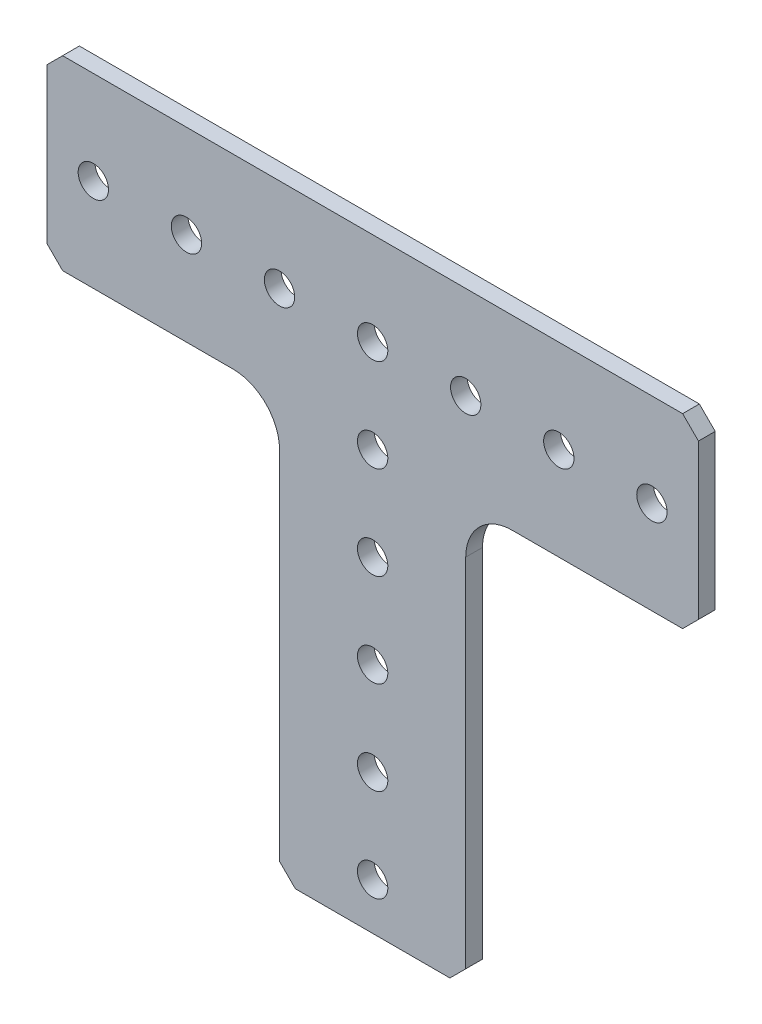
ISO-10303-21;
HEADER;
FILE_DESCRIPTION(('STEP AP214'),'2;1');
FILE_NAME('part.step','',(''),(''),'','','');
FILE_SCHEMA(('AUTOMOTIVE_DESIGN { 1 0 10303 214 1 1 1 1 }'));
ENDSEC;
DATA;
#1=APPLICATION_CONTEXT('core data for automotive mechanical design processes');
#2=APPLICATION_PROTOCOL_DEFINITION('international standard','automotive_design',2000,#1);
#3=PRODUCT_CONTEXT('',#1,'mechanical');
#4=PRODUCT('Part','Part','',(#3));
#5=PRODUCT_RELATED_PRODUCT_CATEGORY('part','',(#4));
#6=PRODUCT_DEFINITION_FORMATION('','',#4);
#7=PRODUCT_DEFINITION_CONTEXT('part definition',#1,'design');
#8=PRODUCT_DEFINITION('design','',#6,#7);
#9=PRODUCT_DEFINITION_SHAPE('','',#8);
#10=(LENGTH_UNIT() NAMED_UNIT(*) SI_UNIT(.MILLI.,.METRE.));
#11=(NAMED_UNIT(*) PLANE_ANGLE_UNIT() SI_UNIT($,.RADIAN.));
#12=(NAMED_UNIT(*) SI_UNIT($,.STERADIAN.) SOLID_ANGLE_UNIT());
#13=UNCERTAINTY_MEASURE_WITH_UNIT(LENGTH_MEASURE(1.E-05),#10,'distance_accuracy_value','');
#14=(GEOMETRIC_REPRESENTATION_CONTEXT(3) GLOBAL_UNCERTAINTY_ASSIGNED_CONTEXT((#13)) GLOBAL_UNIT_ASSIGNED_CONTEXT((#10,
#11,#12)) REPRESENTATION_CONTEXT('',''));
#15=CARTESIAN_POINT('',(0.,0.,0.));
#16=DIRECTION('',(0.,0.,1.));
#17=DIRECTION('',(1.,0.,0.));
#18=AXIS2_PLACEMENT_3D('',#15,#16,#17);
#19=CARTESIAN_POINT('',(10.541,-57.15,0.));
#20=DIRECTION('',(0.707106781186548,-0.707106781186547,0.));
#21=DIRECTION('',(0.707106781186547,0.707106781186548,0.));
#22=AXIS2_PLACEMENT_3D('',#19,#20,#21);
#23=PLANE('',#22);
#24=DIRECTION('',(0.707106781186547,0.707106781186548,0.));
#25=VECTOR('',#24,1.);
#26=CARTESIAN_POINT('',(10.541,-57.15,2.286));
#27=LINE('',#26,#25);
#28=CARTESIAN_POINT('',(10.541,-57.15,2.286));
#29=VERTEX_POINT('',#28);
#30=CARTESIAN_POINT('',(12.7,-54.991,2.286));
#31=VERTEX_POINT('',#30);
#32=EDGE_CURVE('E182',#29,#31,#27,.T.);
#33=ORIENTED_EDGE('',*,*,#32,.F.);
#34=DIRECTION('',(0.,0.,1.));
#35=VECTOR('',#34,1.);
#36=CARTESIAN_POINT('',(10.541,-57.15,0.));
#37=LINE('',#36,#35);
#38=CARTESIAN_POINT('',(10.541,-57.15,0.));
#39=VERTEX_POINT('',#38);
#40=EDGE_CURVE('E11',#39,#29,#37,.T.);
#41=ORIENTED_EDGE('',*,*,#40,.F.);
#42=DIRECTION('',(0.707106781186547,0.707106781186548,0.));
#43=VECTOR('',#42,1.);
#44=CARTESIAN_POINT('',(10.541,-57.15,0.));
#45=LINE('',#44,#43);
#46=CARTESIAN_POINT('',(12.7,-54.991,0.));
#47=VERTEX_POINT('',#46);
#48=EDGE_CURVE('E227',#39,#47,#45,.T.);
#49=ORIENTED_EDGE('',*,*,#48,.T.);
#50=DIRECTION('',(0.,0.,1.));
#51=VECTOR('',#50,1.);
#52=CARTESIAN_POINT('',(12.7,-54.991,0.));
#53=LINE('',#52,#51);
#54=EDGE_CURVE('E40',#47,#31,#53,.T.);
#55=ORIENTED_EDGE('',*,*,#54,.T.);
#56=EDGE_LOOP('',(#33,#41,#49,#55));
#57=FACE_BOUND('',#56,.T.);
#58=ADVANCED_FACE('F37',(#57),#23,.T.);
#59=CARTESIAN_POINT('',(-10.541,-57.15,0.));
#60=DIRECTION('',(0.,-1.,0.));
#61=DIRECTION('',(0.,0.,-1.));
#62=AXIS2_PLACEMENT_3D('',#59,#60,#61);
#63=PLANE('',#62);
#64=DIRECTION('',(1.,0.,0.));
#65=VECTOR('',#64,1.);
#66=CARTESIAN_POINT('',(-10.541,-57.15,2.286));
#67=LINE('',#66,#65);
#68=CARTESIAN_POINT('',(-10.541,-57.15,2.286));
#69=VERTEX_POINT('',#68);
#70=EDGE_CURVE('E225',#69,#29,#67,.T.);
#71=ORIENTED_EDGE('',*,*,#70,.F.);
#72=DIRECTION('',(0.,0.,1.));
#73=VECTOR('',#72,1.);
#74=CARTESIAN_POINT('',(-10.541,-57.15,0.));
#75=LINE('',#74,#73);
#76=CARTESIAN_POINT('',(-10.541,-57.15,0.));
#77=VERTEX_POINT('',#76);
#78=EDGE_CURVE('E46',#77,#69,#75,.T.);
#79=ORIENTED_EDGE('',*,*,#78,.F.);
#80=DIRECTION('',(1.,0.,0.));
#81=VECTOR('',#80,1.);
#82=CARTESIAN_POINT('',(-10.541,-57.15,0.));
#83=LINE('',#82,#81);
#84=EDGE_CURVE('E172',#77,#39,#83,.T.);
#85=ORIENTED_EDGE('',*,*,#84,.T.);
#86=ORIENTED_EDGE('',*,*,#40,.T.);
#87=EDGE_LOOP('',(#71,#79,#85,#86));
#88=FACE_BOUND('',#87,.T.);
#89=ADVANCED_FACE('F255',(#88),#63,.T.);
#90=CARTESIAN_POINT('',(-12.7,-54.991,0.));
#91=DIRECTION('',(-0.707106781186545,-0.70710678118655,0.));
#92=DIRECTION('',(0.70710678118655,-0.707106781186545,0.));
#93=AXIS2_PLACEMENT_3D('',#90,#91,#92);
#94=PLANE('',#93);
#95=DIRECTION('',(0.70710678118655,-0.707106781186545,0.));
#96=VECTOR('',#95,1.);
#97=CARTESIAN_POINT('',(-12.7,-54.991,2.286));
#98=LINE('',#97,#96);
#99=CARTESIAN_POINT('',(-12.7,-54.991,2.286));
#100=VERTEX_POINT('',#99);
#101=EDGE_CURVE('E159',#100,#69,#98,.T.);
#102=ORIENTED_EDGE('',*,*,#101,.F.);
#103=DIRECTION('',(0.,0.,1.));
#104=VECTOR('',#103,1.);
#105=CARTESIAN_POINT('',(-12.7,-54.991,0.));
#106=LINE('',#105,#104);
#107=CARTESIAN_POINT('',(-12.7,-54.991,0.));
#108=VERTEX_POINT('',#107);
#109=EDGE_CURVE('E154',#108,#100,#106,.T.);
#110=ORIENTED_EDGE('',*,*,#109,.F.);
#111=DIRECTION('',(0.70710678118655,-0.707106781186545,0.));
#112=VECTOR('',#111,1.);
#113=CARTESIAN_POINT('',(-12.7,-54.991,0.));
#114=LINE('',#113,#112);
#115=EDGE_CURVE('E157',#108,#77,#114,.T.);
#116=ORIENTED_EDGE('',*,*,#115,.T.);
#117=ORIENTED_EDGE('',*,*,#78,.T.);
#118=EDGE_LOOP('',(#102,#110,#116,#117));
#119=FACE_BOUND('',#118,.T.);
#120=ADVANCED_FACE('F156',(#119),#94,.T.);
#121=CARTESIAN_POINT('',(-12.7,-6.34999999999998,0.));
#122=DIRECTION('',(-1.,0.,0.));
#123=DIRECTION('',(0.,-1.,0.));
#124=AXIS2_PLACEMENT_3D('',#121,#122,#123);
#125=PLANE('',#124);
#126=DIRECTION('',(0.,-1.,0.));
#127=VECTOR('',#126,1.);
#128=CARTESIAN_POINT('',(-12.7,-6.34999999999998,2.286));
#129=LINE('',#128,#127);
#130=CARTESIAN_POINT('',(-12.7,-6.34999999999999,2.286));
#131=VERTEX_POINT('',#130);
#132=EDGE_CURVE('E222',#131,#100,#129,.T.);
#133=ORIENTED_EDGE('',*,*,#132,.F.);
#134=DIRECTION('',(0.,0.,1.));
#135=VECTOR('',#134,1.);
#136=CARTESIAN_POINT('',(-12.7,-6.34999999999999,0.));
#137=LINE('',#136,#135);
#138=CARTESIAN_POINT('',(-12.7,-6.34999999999999,0.));
#139=VERTEX_POINT('',#138);
#140=EDGE_CURVE('E164',#139,#131,#137,.T.);
#141=ORIENTED_EDGE('',*,*,#140,.F.);
#142=DIRECTION('',(0.,-1.,0.));
#143=VECTOR('',#142,1.);
#144=CARTESIAN_POINT('',(-12.7,-6.34999999999998,0.));
#145=LINE('',#144,#143);
#146=EDGE_CURVE('E170',#139,#108,#145,.T.);
#147=ORIENTED_EDGE('',*,*,#146,.T.);
#148=ORIENTED_EDGE('',*,*,#109,.T.);
#149=EDGE_LOOP('',(#133,#141,#147,#148));
#150=FACE_BOUND('',#149,.T.);
#151=ADVANCED_FACE('F174',(#150),#125,.T.);
#152=CARTESIAN_POINT('',(-19.05,-6.34999999999999,0.));
#153=DIRECTION('',(0.,0.,1.));
#154=DIRECTION('',(1.,0.,0.));
#155=AXIS2_PLACEMENT_3D('',#152,#153,#154);
#156=CYLINDRICAL_SURFACE('',#155,6.35);
#157=CARTESIAN_POINT('',(-19.05,-6.34999999999999,2.286));
#158=DIRECTION('',(0.,0.,-1.));
#159=DIRECTION('',(-1.,0.,0.));
#160=AXIS2_PLACEMENT_3D('',#157,#158,#159);
#161=CIRCLE('',#160,6.35);
#162=CARTESIAN_POINT('',(-19.05,0.,2.286));
#163=VERTEX_POINT('',#162);
#164=EDGE_CURVE('E219',#163,#131,#161,.T.);
#165=ORIENTED_EDGE('',*,*,#164,.F.);
#166=DIRECTION('',(0.,0.,1.));
#167=VECTOR('',#166,1.);
#168=CARTESIAN_POINT('',(-19.05,0.,0.));
#169=LINE('',#168,#167);
#170=CARTESIAN_POINT('',(-19.05,0.,0.));
#171=VERTEX_POINT('',#170);
#172=EDGE_CURVE('E231',#171,#163,#169,.T.);
#173=ORIENTED_EDGE('',*,*,#172,.F.);
#174=CARTESIAN_POINT('',(-19.05,-6.34999999999999,0.));
#175=DIRECTION('',(0.,0.,-1.));
#176=DIRECTION('',(-1.,0.,0.));
#177=AXIS2_PLACEMENT_3D('',#174,#175,#176);
#178=CIRCLE('',#177,6.35);
#179=EDGE_CURVE('E175',#171,#139,#178,.T.);
#180=ORIENTED_EDGE('',*,*,#179,.T.);
#181=ORIENTED_EDGE('',*,*,#140,.T.);
#182=EDGE_LOOP('',(#165,#173,#180,#181));
#183=FACE_BOUND('',#182,.T.);
#184=ADVANCED_FACE('F268',(#183),#156,.F.);
#185=CARTESIAN_POINT('',(-42.291,0.,0.));
#186=DIRECTION('',(0.,-1.,0.));
#187=DIRECTION('',(1.,0.,0.));
#188=AXIS2_PLACEMENT_3D('',#185,#186,#187);
#189=PLANE('',#188);
#190=DIRECTION('',(1.,0.,0.));
#191=VECTOR('',#190,1.);
#192=CARTESIAN_POINT('',(-42.291,0.,2.286));
#193=LINE('',#192,#191);
#194=CARTESIAN_POINT('',(-42.291,0.,2.286));
#195=VERTEX_POINT('',#194);
#196=EDGE_CURVE('E216',#195,#163,#193,.T.);
#197=ORIENTED_EDGE('',*,*,#196,.F.);
#198=DIRECTION('',(0.,0.,1.));
#199=VECTOR('',#198,1.);
#200=CARTESIAN_POINT('',(-42.291,0.,0.));
#201=LINE('',#200,#199);
#202=CARTESIAN_POINT('',(-42.291,0.,0.));
#203=VERTEX_POINT('',#202);
#204=EDGE_CURVE('E233',#203,#195,#201,.T.);
#205=ORIENTED_EDGE('',*,*,#204,.F.);
#206=DIRECTION('',(1.,0.,0.));
#207=VECTOR('',#206,1.);
#208=CARTESIAN_POINT('',(-42.291,0.,0.));
#209=LINE('',#208,#207);
#210=EDGE_CURVE('E177',#203,#171,#209,.T.);
#211=ORIENTED_EDGE('',*,*,#210,.T.);
#212=ORIENTED_EDGE('',*,*,#172,.T.);
#213=EDGE_LOOP('',(#197,#205,#211,#212));
#214=FACE_BOUND('',#213,.T.);
#215=ADVANCED_FACE('F271',(#214),#189,.T.);
#216=CARTESIAN_POINT('',(-44.45,2.15899999999999,0.));
#217=DIRECTION('',(-0.707106781186545,-0.70710678118655,0.));
#218=DIRECTION('',(0.70710678118655,-0.707106781186545,0.));
#219=AXIS2_PLACEMENT_3D('',#216,#217,#218);
#220=PLANE('',#219);
#221=DIRECTION('',(0.70710678118655,-0.707106781186545,0.));
#222=VECTOR('',#221,1.);
#223=CARTESIAN_POINT('',(-44.45,2.15899999999999,2.286));
#224=LINE('',#223,#222);
#225=CARTESIAN_POINT('',(-44.45,2.15899999999999,2.286));
#226=VERTEX_POINT('',#225);
#227=EDGE_CURVE('E213',#226,#195,#224,.T.);
#228=ORIENTED_EDGE('',*,*,#227,.F.);
#229=DIRECTION('',(0.,0.,1.));
#230=VECTOR('',#229,1.);
#231=CARTESIAN_POINT('',(-44.45,2.15899999999999,0.));
#232=LINE('',#231,#230);
#233=CARTESIAN_POINT('',(-44.45,2.15899999999999,0.));
#234=VERTEX_POINT('',#233);
#235=EDGE_CURVE('E235',#234,#226,#232,.T.);
#236=ORIENTED_EDGE('',*,*,#235,.F.);
#237=DIRECTION('',(0.70710678118655,-0.707106781186545,0.));
#238=VECTOR('',#237,1.);
#239=CARTESIAN_POINT('',(-44.45,2.15899999999999,0.));
#240=LINE('',#239,#238);
#241=EDGE_CURVE('E473',#234,#203,#240,.T.);
#242=ORIENTED_EDGE('',*,*,#241,.T.);
#243=ORIENTED_EDGE('',*,*,#204,.T.);
#244=EDGE_LOOP('',(#228,#236,#242,#243));
#245=FACE_BOUND('',#244,.T.);
#246=ADVANCED_FACE('F275',(#245),#220,.T.);
#247=CARTESIAN_POINT('',(-44.45,23.241,0.));
#248=DIRECTION('',(-1.,0.,0.));
#249=DIRECTION('',(0.,-1.,0.));
#250=AXIS2_PLACEMENT_3D('',#247,#248,#249);
#251=PLANE('',#250);
#252=DIRECTION('',(0.,-1.,0.));
#253=VECTOR('',#252,1.);
#254=CARTESIAN_POINT('',(-44.45,23.241,2.286));
#255=LINE('',#254,#253);
#256=CARTESIAN_POINT('',(-44.45,23.241,2.286));
#257=VERTEX_POINT('',#256);
#258=EDGE_CURVE('E210',#257,#226,#255,.T.);
#259=ORIENTED_EDGE('',*,*,#258,.F.);
#260=DIRECTION('',(0.,0.,1.));
#261=VECTOR('',#260,1.);
#262=CARTESIAN_POINT('',(-44.45,23.241,0.));
#263=LINE('',#262,#261);
#264=CARTESIAN_POINT('',(-44.45,23.241,0.));
#265=VERTEX_POINT('',#264);
#266=EDGE_CURVE('E237',#265,#257,#263,.T.);
#267=ORIENTED_EDGE('',*,*,#266,.F.);
#268=DIRECTION('',(0.,-1.,0.));
#269=VECTOR('',#268,1.);
#270=CARTESIAN_POINT('',(-44.45,23.241,0.));
#271=LINE('',#270,#269);
#272=EDGE_CURVE('E470',#265,#234,#271,.T.);
#273=ORIENTED_EDGE('',*,*,#272,.T.);
#274=ORIENTED_EDGE('',*,*,#235,.T.);
#275=EDGE_LOOP('',(#259,#267,#273,#274));
#276=FACE_BOUND('',#275,.T.);
#277=ADVANCED_FACE('F279',(#276),#251,.T.);
#278=CARTESIAN_POINT('',(-42.291,25.4,0.));
#279=DIRECTION('',(-0.707106781186543,0.707106781186552,0.));
#280=DIRECTION('',(-0.707106781186552,-0.707106781186543,0.));
#281=AXIS2_PLACEMENT_3D('',#278,#279,#280);
#282=PLANE('',#281);
#283=DIRECTION('',(-0.707106781186552,-0.707106781186543,0.));
#284=VECTOR('',#283,1.);
#285=CARTESIAN_POINT('',(-42.291,25.4,2.286));
#286=LINE('',#285,#284);
#287=CARTESIAN_POINT('',(-42.291,25.4,2.286));
#288=VERTEX_POINT('',#287);
#289=EDGE_CURVE('E207',#288,#257,#286,.T.);
#290=ORIENTED_EDGE('',*,*,#289,.F.);
#291=DIRECTION('',(0.,0.,1.));
#292=VECTOR('',#291,1.);
#293=CARTESIAN_POINT('',(-42.291,25.4,0.));
#294=LINE('',#293,#292);
#295=CARTESIAN_POINT('',(-42.291,25.4,0.));
#296=VERTEX_POINT('',#295);
#297=EDGE_CURVE('E239',#296,#288,#294,.T.);
#298=ORIENTED_EDGE('',*,*,#297,.F.);
#299=DIRECTION('',(-0.707106781186552,-0.707106781186543,0.));
#300=VECTOR('',#299,1.);
#301=CARTESIAN_POINT('',(-42.291,25.4,0.));
#302=LINE('',#301,#300);
#303=EDGE_CURVE('E467',#296,#265,#302,.T.);
#304=ORIENTED_EDGE('',*,*,#303,.T.);
#305=ORIENTED_EDGE('',*,*,#266,.T.);
#306=EDGE_LOOP('',(#290,#298,#304,#305));
#307=FACE_BOUND('',#306,.T.);
#308=ADVANCED_FACE('F283',(#307),#282,.T.);
#309=CARTESIAN_POINT('',(42.291,25.4,0.));
#310=DIRECTION('',(0.,1.,0.));
#311=DIRECTION('',(-1.,0.,0.));
#312=AXIS2_PLACEMENT_3D('',#309,#310,#311);
#313=PLANE('',#312);
#314=DIRECTION('',(-1.,0.,0.));
#315=VECTOR('',#314,1.);
#316=CARTESIAN_POINT('',(42.291,25.4,2.286));
#317=LINE('',#316,#315);
#318=CARTESIAN_POINT('',(42.291,25.4,2.286));
#319=VERTEX_POINT('',#318);
#320=EDGE_CURVE('E204',#319,#288,#317,.T.);
#321=ORIENTED_EDGE('',*,*,#320,.F.);
#322=DIRECTION('',(0.,0.,1.));
#323=VECTOR('',#322,1.);
#324=CARTESIAN_POINT('',(42.291,25.4,0.));
#325=LINE('',#324,#323);
#326=CARTESIAN_POINT('',(42.291,25.4,0.));
#327=VERTEX_POINT('',#326);
#328=EDGE_CURVE('E241',#327,#319,#325,.T.);
#329=ORIENTED_EDGE('',*,*,#328,.F.);
#330=DIRECTION('',(-1.,0.,0.));
#331=VECTOR('',#330,1.);
#332=CARTESIAN_POINT('',(42.291,25.4,0.));
#333=LINE('',#332,#331);
#334=EDGE_CURVE('E464',#327,#296,#333,.T.);
#335=ORIENTED_EDGE('',*,*,#334,.T.);
#336=ORIENTED_EDGE('',*,*,#297,.T.);
#337=EDGE_LOOP('',(#321,#329,#335,#336));
#338=FACE_BOUND('',#337,.T.);
#339=ADVANCED_FACE('F287',(#338),#313,.T.);
#340=CARTESIAN_POINT('',(44.45,23.241,0.));
#341=DIRECTION('',(0.707106781186546,0.707106781186549,0.));
#342=DIRECTION('',(-0.707106781186549,0.707106781186546,0.));
#343=AXIS2_PLACEMENT_3D('',#340,#341,#342);
#344=PLANE('',#343);
#345=DIRECTION('',(-0.707106781186549,0.707106781186546,0.));
#346=VECTOR('',#345,1.);
#347=CARTESIAN_POINT('',(44.45,23.241,2.286));
#348=LINE('',#347,#346);
#349=CARTESIAN_POINT('',(44.45,23.241,2.286));
#350=VERTEX_POINT('',#349);
#351=EDGE_CURVE('E201',#350,#319,#348,.T.);
#352=ORIENTED_EDGE('',*,*,#351,.F.);
#353=DIRECTION('',(0.,0.,1.));
#354=VECTOR('',#353,1.);
#355=CARTESIAN_POINT('',(44.45,23.241,0.));
#356=LINE('',#355,#354);
#357=CARTESIAN_POINT('',(44.45,23.241,0.));
#358=VERTEX_POINT('',#357);
#359=EDGE_CURVE('E243',#358,#350,#356,.T.);
#360=ORIENTED_EDGE('',*,*,#359,.F.);
#361=DIRECTION('',(-0.707106781186549,0.707106781186546,0.));
#362=VECTOR('',#361,1.);
#363=CARTESIAN_POINT('',(44.45,23.241,0.));
#364=LINE('',#363,#362);
#365=EDGE_CURVE('E461',#358,#327,#364,.T.);
#366=ORIENTED_EDGE('',*,*,#365,.T.);
#367=ORIENTED_EDGE('',*,*,#328,.T.);
#368=EDGE_LOOP('',(#352,#360,#366,#367));
#369=FACE_BOUND('',#368,.T.);
#370=ADVANCED_FACE('F291',(#369),#344,.T.);
#371=CARTESIAN_POINT('',(44.45,2.15900000000002,0.));
#372=DIRECTION('',(1.,0.,0.));
#373=DIRECTION('',(0.,1.,0.));
#374=AXIS2_PLACEMENT_3D('',#371,#372,#373);
#375=PLANE('',#374);
#376=DIRECTION('',(0.,1.,0.));
#377=VECTOR('',#376,1.);
#378=CARTESIAN_POINT('',(44.45,2.15900000000002,2.286));
#379=LINE('',#378,#377);
#380=CARTESIAN_POINT('',(44.45,2.15900000000002,2.286));
#381=VERTEX_POINT('',#380);
#382=EDGE_CURVE('E198',#381,#350,#379,.T.);
#383=ORIENTED_EDGE('',*,*,#382,.F.);
#384=DIRECTION('',(0.,0.,1.));
#385=VECTOR('',#384,1.);
#386=CARTESIAN_POINT('',(44.45,2.15900000000002,0.));
#387=LINE('',#386,#385);
#388=CARTESIAN_POINT('',(44.45,2.15900000000002,0.));
#389=VERTEX_POINT('',#388);
#390=EDGE_CURVE('E245',#389,#381,#387,.T.);
#391=ORIENTED_EDGE('',*,*,#390,.F.);
#392=DIRECTION('',(0.,1.,0.));
#393=VECTOR('',#392,1.);
#394=CARTESIAN_POINT('',(44.45,2.15900000000002,0.));
#395=LINE('',#394,#393);
#396=EDGE_CURVE('E458',#389,#358,#395,.T.);
#397=ORIENTED_EDGE('',*,*,#396,.T.);
#398=ORIENTED_EDGE('',*,*,#359,.T.);
#399=EDGE_LOOP('',(#383,#391,#397,#398));
#400=FACE_BOUND('',#399,.T.);
#401=ADVANCED_FACE('F295',(#400),#375,.T.);
#402=CARTESIAN_POINT('',(42.291,0.,0.));
#403=DIRECTION('',(0.707106781186549,-0.707106781186547,0.));
#404=DIRECTION('',(0.707106781186547,0.707106781186549,0.));
#405=AXIS2_PLACEMENT_3D('',#402,#403,#404);
#406=PLANE('',#405);
#407=DIRECTION('',(0.707106781186546,0.707106781186548,0.));
#408=VECTOR('',#407,1.);
#409=CARTESIAN_POINT('',(42.291,0.,2.286));
#410=LINE('',#409,#408);
#411=CARTESIAN_POINT('',(42.291,0.,2.286));
#412=VERTEX_POINT('',#411);
#413=EDGE_CURVE('E195',#412,#381,#410,.T.);
#414=ORIENTED_EDGE('',*,*,#413,.F.);
#415=DIRECTION('',(0.,0.,1.));
#416=VECTOR('',#415,1.);
#417=CARTESIAN_POINT('',(42.291,0.,0.));
#418=LINE('',#417,#416);
#419=CARTESIAN_POINT('',(42.291,0.,0.));
#420=VERTEX_POINT('',#419);
#421=EDGE_CURVE('E247',#420,#412,#418,.T.);
#422=ORIENTED_EDGE('',*,*,#421,.F.);
#423=DIRECTION('',(0.707106781186546,0.707106781186548,0.));
#424=VECTOR('',#423,1.);
#425=CARTESIAN_POINT('',(42.291,0.,0.));
#426=LINE('',#425,#424);
#427=EDGE_CURVE('E455',#420,#389,#426,.T.);
#428=ORIENTED_EDGE('',*,*,#427,.T.);
#429=ORIENTED_EDGE('',*,*,#390,.T.);
#430=EDGE_LOOP('',(#414,#422,#428,#429));
#431=FACE_BOUND('',#430,.T.);
#432=ADVANCED_FACE('F299',(#431),#406,.T.);
#433=CARTESIAN_POINT('',(19.05,0.,0.));
#434=DIRECTION('',(0.,-1.,0.));
#435=DIRECTION('',(1.,0.,0.));
#436=AXIS2_PLACEMENT_3D('',#433,#434,#435);
#437=PLANE('',#436);
#438=DIRECTION('',(1.,0.,0.));
#439=VECTOR('',#438,1.);
#440=CARTESIAN_POINT('',(19.05,0.,2.286));
#441=LINE('',#440,#439);
#442=CARTESIAN_POINT('',(19.05,0.,2.286));
#443=VERTEX_POINT('',#442);
#444=EDGE_CURVE('E192',#443,#412,#441,.T.);
#445=ORIENTED_EDGE('',*,*,#444,.F.);
#446=DIRECTION('',(0.,0.,1.));
#447=VECTOR('',#446,1.);
#448=CARTESIAN_POINT('',(19.05,0.,0.));
#449=LINE('',#448,#447);
#450=CARTESIAN_POINT('',(19.05,0.,0.));
#451=VERTEX_POINT('',#450);
#452=EDGE_CURVE('E249',#451,#443,#449,.T.);
#453=ORIENTED_EDGE('',*,*,#452,.F.);
#454=DIRECTION('',(1.,0.,0.));
#455=VECTOR('',#454,1.);
#456=CARTESIAN_POINT('',(19.05,0.,0.));
#457=LINE('',#456,#455);
#458=EDGE_CURVE('E452',#451,#420,#457,.T.);
#459=ORIENTED_EDGE('',*,*,#458,.T.);
#460=ORIENTED_EDGE('',*,*,#421,.T.);
#461=EDGE_LOOP('',(#445,#453,#459,#460));
#462=FACE_BOUND('',#461,.T.);
#463=ADVANCED_FACE('F303',(#462),#437,.T.);
#464=CARTESIAN_POINT('',(19.05,-6.34999999999998,0.));
#465=DIRECTION('',(0.,0.,1.));
#466=DIRECTION('',(1.,0.,0.));
#467=AXIS2_PLACEMENT_3D('',#464,#465,#466);
#468=CYLINDRICAL_SURFACE('',#467,6.35);
#469=CARTESIAN_POINT('',(19.05,-6.34999999999998,2.286));
#470=DIRECTION('',(0.,0.,-1.));
#471=DIRECTION('',(-1.,0.,0.));
#472=AXIS2_PLACEMENT_3D('',#469,#470,#471);
#473=CIRCLE('',#472,6.35);
#474=CARTESIAN_POINT('',(12.7,-6.34999999999998,2.286));
#475=VERTEX_POINT('',#474);
#476=EDGE_CURVE('E189',#475,#443,#473,.T.);
#477=ORIENTED_EDGE('',*,*,#476,.F.);
#478=DIRECTION('',(0.,0.,1.));
#479=VECTOR('',#478,1.);
#480=CARTESIAN_POINT('',(12.7,-6.34999999999998,0.));
#481=LINE('',#480,#479);
#482=CARTESIAN_POINT('',(12.7,-6.34999999999998,0.));
#483=VERTEX_POINT('',#482);
#484=EDGE_CURVE('E250',#483,#475,#481,.T.);
#485=ORIENTED_EDGE('',*,*,#484,.F.);
#486=CARTESIAN_POINT('',(19.05,-6.34999999999998,0.));
#487=DIRECTION('',(0.,0.,-1.));
#488=DIRECTION('',(-1.,0.,0.));
#489=AXIS2_PLACEMENT_3D('',#486,#487,#488);
#490=CIRCLE('',#489,6.35);
#491=EDGE_CURVE('E449',#483,#451,#490,.T.);
#492=ORIENTED_EDGE('',*,*,#491,.T.);
#493=ORIENTED_EDGE('',*,*,#452,.T.);
#494=EDGE_LOOP('',(#477,#485,#492,#493));
#495=FACE_BOUND('',#494,.T.);
#496=ADVANCED_FACE('F307',(#495),#468,.F.);
#497=CARTESIAN_POINT('',(12.7,-54.991,0.));
#498=DIRECTION('',(1.,0.,0.));
#499=DIRECTION('',(0.,1.,0.));
#500=AXIS2_PLACEMENT_3D('',#497,#498,#499);
#501=PLANE('',#500);
#502=DIRECTION('',(0.,1.,0.));
#503=VECTOR('',#502,1.);
#504=CARTESIAN_POINT('',(12.7,-54.991,2.286));
#505=LINE('',#504,#503);
#506=EDGE_CURVE('E185',#31,#475,#505,.T.);
#507=ORIENTED_EDGE('',*,*,#506,.F.);
#508=ORIENTED_EDGE('',*,*,#54,.F.);
#509=DIRECTION('',(0.,1.,0.));
#510=VECTOR('',#509,1.);
#511=CARTESIAN_POINT('',(12.7,-54.991,0.));
#512=LINE('',#511,#510);
#513=EDGE_CURVE('E447',#47,#483,#512,.T.);
#514=ORIENTED_EDGE('',*,*,#513,.T.);
#515=ORIENTED_EDGE('',*,*,#484,.T.);
#516=EDGE_LOOP('',(#507,#508,#514,#515));
#517=FACE_BOUND('',#516,.T.);
#518=ADVANCED_FACE('F252',(#517),#501,.T.);
#519=CARTESIAN_POINT('',(19.05,-6.34999999999998,0.));
#520=DIRECTION('',(0.,0.,-1.));
#521=DIRECTION('',(-1.,0.,0.));
#522=AXIS2_PLACEMENT_3D('',#519,#520,#521);
#523=PLANE('',#522);
#524=CARTESIAN_POINT('',(0.,-50.8,0.));
#525=DIRECTION('',(0.,0.,1.));
#526=DIRECTION('',(-1.,0.,0.));
#527=AXIS2_PLACEMENT_3D('',#524,#525,#526);
#528=CIRCLE('',#527,2.0701);
#529=CARTESIAN_POINT('',(-2.07009999999999,-50.8,0.));
#530=VERTEX_POINT('',#529);
#531=EDGE_CURVE('E374',#530,#530,#528,.T.);
#532=ORIENTED_EDGE('',*,*,#531,.T.);
#533=EDGE_LOOP('',(#532));
#534=FACE_BOUND('',#533,.T.);
#535=CARTESIAN_POINT('',(0.,-25.4,0.));
#536=DIRECTION('',(0.,0.,1.));
#537=DIRECTION('',(-1.,0.,0.));
#538=AXIS2_PLACEMENT_3D('',#535,#536,#537);
#539=CIRCLE('',#538,2.0701);
#540=CARTESIAN_POINT('',(-2.0701,-25.4,0.));
#541=VERTEX_POINT('',#540);
#542=EDGE_CURVE('E382',#541,#541,#539,.T.);
#543=ORIENTED_EDGE('',*,*,#542,.T.);
#544=EDGE_LOOP('',(#543));
#545=FACE_BOUND('',#544,.T.);
#546=CARTESIAN_POINT('',(0.,0.,0.));
#547=DIRECTION('',(0.,0.,1.));
#548=DIRECTION('',(-1.,0.,0.));
#549=AXIS2_PLACEMENT_3D('',#546,#547,#548);
#550=CIRCLE('',#549,2.0701);
#551=CARTESIAN_POINT('',(-2.0701,0.,0.));
#552=VERTEX_POINT('',#551);
#553=EDGE_CURVE('E388',#552,#552,#550,.T.);
#554=ORIENTED_EDGE('',*,*,#553,.T.);
#555=EDGE_LOOP('',(#554));
#556=FACE_BOUND('',#555,.T.);
#557=CARTESIAN_POINT('',(25.4,12.7,0.));
#558=DIRECTION('',(0.,0.,1.));
#559=DIRECTION('',(-1.,0.,0.));
#560=AXIS2_PLACEMENT_3D('',#557,#558,#559);
#561=CIRCLE('',#560,2.0701);
#562=CARTESIAN_POINT('',(23.3299,12.7,0.));
#563=VERTEX_POINT('',#562);
#564=EDGE_CURVE('E394',#563,#563,#561,.T.);
#565=ORIENTED_EDGE('',*,*,#564,.T.);
#566=EDGE_LOOP('',(#565));
#567=FACE_BOUND('',#566,.T.);
#568=CARTESIAN_POINT('',(0.,12.7,0.));
#569=DIRECTION('',(0.,0.,1.));
#570=DIRECTION('',(-1.,0.,0.));
#571=AXIS2_PLACEMENT_3D('',#568,#569,#570);
#572=CIRCLE('',#571,2.0701);
#573=CARTESIAN_POINT('',(-2.0701,12.7,0.));
#574=VERTEX_POINT('',#573);
#575=EDGE_CURVE('E400',#574,#574,#572,.T.);
#576=ORIENTED_EDGE('',*,*,#575,.T.);
#577=EDGE_LOOP('',(#576));
#578=FACE_BOUND('',#577,.T.);
#579=CARTESIAN_POINT('',(-25.4,12.7,0.));
#580=DIRECTION('',(0.,0.,1.));
#581=DIRECTION('',(-1.,0.,0.));
#582=AXIS2_PLACEMENT_3D('',#579,#580,#581);
#583=CIRCLE('',#582,2.0701);
#584=CARTESIAN_POINT('',(-27.4701,12.7,0.));
#585=VERTEX_POINT('',#584);
#586=EDGE_CURVE('E406',#585,#585,#583,.T.);
#587=ORIENTED_EDGE('',*,*,#586,.T.);
#588=EDGE_LOOP('',(#587));
#589=FACE_BOUND('',#588,.T.);
#590=CARTESIAN_POINT('',(-38.1,12.7,0.));
#591=DIRECTION('',(0.,0.,1.));
#592=DIRECTION('',(-1.,0.,0.));
#593=AXIS2_PLACEMENT_3D('',#590,#591,#592);
#594=CIRCLE('',#593,2.0701);
#595=CARTESIAN_POINT('',(-40.1701,12.7,0.));
#596=VERTEX_POINT('',#595);
#597=EDGE_CURVE('E412',#596,#596,#594,.T.);
#598=ORIENTED_EDGE('',*,*,#597,.T.);
#599=EDGE_LOOP('',(#598));
#600=FACE_BOUND('',#599,.T.);
#601=CARTESIAN_POINT('',(-12.7,12.7,0.));
#602=DIRECTION('',(0.,0.,1.));
#603=DIRECTION('',(-1.,0.,0.));
#604=AXIS2_PLACEMENT_3D('',#601,#602,#603);
#605=CIRCLE('',#604,2.0701);
#606=CARTESIAN_POINT('',(-14.7701,12.7,0.));
#607=VERTEX_POINT('',#606);
#608=EDGE_CURVE('E418',#607,#607,#605,.T.);
#609=ORIENTED_EDGE('',*,*,#608,.T.);
#610=EDGE_LOOP('',(#609));
#611=FACE_BOUND('',#610,.T.);
#612=CARTESIAN_POINT('',(12.7,12.7,0.));
#613=DIRECTION('',(0.,0.,1.));
#614=DIRECTION('',(-1.,0.,0.));
#615=AXIS2_PLACEMENT_3D('',#612,#613,#614);
#616=CIRCLE('',#615,2.0701);
#617=CARTESIAN_POINT('',(10.6299,12.7,0.));
#618=VERTEX_POINT('',#617);
#619=EDGE_CURVE('E424',#618,#618,#616,.T.);
#620=ORIENTED_EDGE('',*,*,#619,.T.);
#621=EDGE_LOOP('',(#620));
#622=FACE_BOUND('',#621,.T.);
#623=CARTESIAN_POINT('',(38.1,12.7,0.));
#624=DIRECTION('',(0.,0.,1.));
#625=DIRECTION('',(-1.,0.,0.));
#626=AXIS2_PLACEMENT_3D('',#623,#624,#625);
#627=CIRCLE('',#626,2.0701);
#628=CARTESIAN_POINT('',(36.0299,12.7,0.));
#629=VERTEX_POINT('',#628);
#630=EDGE_CURVE('E430',#629,#629,#627,.T.);
#631=ORIENTED_EDGE('',*,*,#630,.T.);
#632=EDGE_LOOP('',(#631));
#633=FACE_BOUND('',#632,.T.);
#634=CARTESIAN_POINT('',(0.,-12.7,0.));
#635=DIRECTION('',(0.,0.,1.));
#636=DIRECTION('',(-1.,0.,0.));
#637=AXIS2_PLACEMENT_3D('',#634,#635,#636);
#638=CIRCLE('',#637,2.0701);
#639=CARTESIAN_POINT('',(-2.0701,-12.7,0.));
#640=VERTEX_POINT('',#639);
#641=EDGE_CURVE('E436',#640,#640,#638,.T.);
#642=ORIENTED_EDGE('',*,*,#641,.T.);
#643=EDGE_LOOP('',(#642));
#644=FACE_BOUND('',#643,.T.);
#645=CARTESIAN_POINT('',(0.,-38.1,0.));
#646=DIRECTION('',(0.,0.,1.));
#647=DIRECTION('',(-1.,0.,0.));
#648=AXIS2_PLACEMENT_3D('',#645,#646,#647);
#649=CIRCLE('',#648,2.0701);
#650=CARTESIAN_POINT('',(-2.0701,-38.1,0.));
#651=VERTEX_POINT('',#650);
#652=EDGE_CURVE('E186',#651,#651,#649,.T.);
#653=ORIENTED_EDGE('',*,*,#652,.T.);
#654=EDGE_LOOP('',(#653));
#655=FACE_BOUND('',#654,.T.);
#656=ORIENTED_EDGE('',*,*,#48,.F.);
#657=ORIENTED_EDGE('',*,*,#84,.F.);
#658=ORIENTED_EDGE('',*,*,#115,.F.);
#659=ORIENTED_EDGE('',*,*,#146,.F.);
#660=ORIENTED_EDGE('',*,*,#179,.F.);
#661=ORIENTED_EDGE('',*,*,#210,.F.);
#662=ORIENTED_EDGE('',*,*,#241,.F.);
#663=ORIENTED_EDGE('',*,*,#272,.F.);
#664=ORIENTED_EDGE('',*,*,#303,.F.);
#665=ORIENTED_EDGE('',*,*,#334,.F.);
#666=ORIENTED_EDGE('',*,*,#365,.F.);
#667=ORIENTED_EDGE('',*,*,#396,.F.);
#668=ORIENTED_EDGE('',*,*,#427,.F.);
#669=ORIENTED_EDGE('',*,*,#458,.F.);
#670=ORIENTED_EDGE('',*,*,#491,.F.);
#671=ORIENTED_EDGE('',*,*,#513,.F.);
#672=EDGE_LOOP('',(#656,#657,#658,#659,#660,#661,#662,#663,#664,#665,#666,#667,#668,#669,#670,#671));
#673=FACE_BOUND('',#672,.T.);
#674=ADVANCED_FACE('F168',(#534,#545,#556,#567,#578,#589,#600,#611,#622,#633,#644,#655,#673),
#523,.T.);
#675=CARTESIAN_POINT('',(19.05,-6.34999999999998,2.286));
#676=DIRECTION('',(0.,0.,-1.));
#677=DIRECTION('',(-1.,0.,0.));
#678=AXIS2_PLACEMENT_3D('',#675,#676,#677);
#679=PLANE('',#678);
#680=CARTESIAN_POINT('',(0.,-50.8,2.286));
#681=DIRECTION('',(0.,0.,1.));
#682=DIRECTION('',(-1.,0.,0.));
#683=AXIS2_PLACEMENT_3D('',#680,#681,#682);
#684=CIRCLE('',#683,2.0701);
#685=CARTESIAN_POINT('',(-2.07009999999999,-50.8,2.286));
#686=VERTEX_POINT('',#685);
#687=EDGE_CURVE('E377',#686,#686,#684,.T.);
#688=ORIENTED_EDGE('',*,*,#687,.F.);
#689=EDGE_LOOP('',(#688));
#690=FACE_BOUND('',#689,.T.);
#691=CARTESIAN_POINT('',(0.,-25.4,2.286));
#692=DIRECTION('',(0.,0.,1.));
#693=DIRECTION('',(-1.,0.,0.));
#694=AXIS2_PLACEMENT_3D('',#691,#692,#693);
#695=CIRCLE('',#694,2.0701);
#696=CARTESIAN_POINT('',(-2.0701,-25.4,2.286));
#697=VERTEX_POINT('',#696);
#698=EDGE_CURVE('E379',#697,#697,#695,.T.);
#699=ORIENTED_EDGE('',*,*,#698,.F.);
#700=EDGE_LOOP('',(#699));
#701=FACE_BOUND('',#700,.T.);
#702=CARTESIAN_POINT('',(0.,0.,2.286));
#703=DIRECTION('',(0.,0.,1.));
#704=DIRECTION('',(-1.,0.,0.));
#705=AXIS2_PLACEMENT_3D('',#702,#703,#704);
#706=CIRCLE('',#705,2.0701);
#707=CARTESIAN_POINT('',(-2.0701,0.,2.286));
#708=VERTEX_POINT('',#707);
#709=EDGE_CURVE('E385',#708,#708,#706,.T.);
#710=ORIENTED_EDGE('',*,*,#709,.F.);
#711=EDGE_LOOP('',(#710));
#712=FACE_BOUND('',#711,.T.);
#713=CARTESIAN_POINT('',(25.4,12.7,2.286));
#714=DIRECTION('',(0.,0.,1.));
#715=DIRECTION('',(-1.,0.,0.));
#716=AXIS2_PLACEMENT_3D('',#713,#714,#715);
#717=CIRCLE('',#716,2.0701);
#718=CARTESIAN_POINT('',(23.3299,12.7,2.286));
#719=VERTEX_POINT('',#718);
#720=EDGE_CURVE('E391',#719,#719,#717,.T.);
#721=ORIENTED_EDGE('',*,*,#720,.F.);
#722=EDGE_LOOP('',(#721));
#723=FACE_BOUND('',#722,.T.);
#724=CARTESIAN_POINT('',(0.,12.7,2.286));
#725=DIRECTION('',(0.,0.,1.));
#726=DIRECTION('',(-1.,0.,0.));
#727=AXIS2_PLACEMENT_3D('',#724,#725,#726);
#728=CIRCLE('',#727,2.0701);
#729=CARTESIAN_POINT('',(-2.0701,12.7,2.286));
#730=VERTEX_POINT('',#729);
#731=EDGE_CURVE('E397',#730,#730,#728,.T.);
#732=ORIENTED_EDGE('',*,*,#731,.F.);
#733=EDGE_LOOP('',(#732));
#734=FACE_BOUND('',#733,.T.);
#735=CARTESIAN_POINT('',(-25.4,12.7,2.286));
#736=DIRECTION('',(0.,0.,1.));
#737=DIRECTION('',(-1.,0.,0.));
#738=AXIS2_PLACEMENT_3D('',#735,#736,#737);
#739=CIRCLE('',#738,2.0701);
#740=CARTESIAN_POINT('',(-27.4701,12.7,2.286));
#741=VERTEX_POINT('',#740);
#742=EDGE_CURVE('E403',#741,#741,#739,.T.);
#743=ORIENTED_EDGE('',*,*,#742,.F.);
#744=EDGE_LOOP('',(#743));
#745=FACE_BOUND('',#744,.T.);
#746=CARTESIAN_POINT('',(-38.1,12.7,2.286));
#747=DIRECTION('',(0.,0.,1.));
#748=DIRECTION('',(-1.,0.,0.));
#749=AXIS2_PLACEMENT_3D('',#746,#747,#748);
#750=CIRCLE('',#749,2.0701);
#751=CARTESIAN_POINT('',(-40.1701,12.7,2.286));
#752=VERTEX_POINT('',#751);
#753=EDGE_CURVE('E409',#752,#752,#750,.T.);
#754=ORIENTED_EDGE('',*,*,#753,.F.);
#755=EDGE_LOOP('',(#754));
#756=FACE_BOUND('',#755,.T.);
#757=CARTESIAN_POINT('',(-12.7,12.7,2.286));
#758=DIRECTION('',(0.,0.,1.));
#759=DIRECTION('',(-1.,0.,0.));
#760=AXIS2_PLACEMENT_3D('',#757,#758,#759);
#761=CIRCLE('',#760,2.0701);
#762=CARTESIAN_POINT('',(-14.7701,12.7,2.286));
#763=VERTEX_POINT('',#762);
#764=EDGE_CURVE('E415',#763,#763,#761,.T.);
#765=ORIENTED_EDGE('',*,*,#764,.F.);
#766=EDGE_LOOP('',(#765));
#767=FACE_BOUND('',#766,.T.);
#768=CARTESIAN_POINT('',(12.7,12.7,2.286));
#769=DIRECTION('',(0.,0.,1.));
#770=DIRECTION('',(-1.,0.,0.));
#771=AXIS2_PLACEMENT_3D('',#768,#769,#770);
#772=CIRCLE('',#771,2.0701);
#773=CARTESIAN_POINT('',(10.6299,12.7,2.286));
#774=VERTEX_POINT('',#773);
#775=EDGE_CURVE('E421',#774,#774,#772,.T.);
#776=ORIENTED_EDGE('',*,*,#775,.F.);
#777=EDGE_LOOP('',(#776));
#778=FACE_BOUND('',#777,.T.);
#779=CARTESIAN_POINT('',(38.1,12.7,2.286));
#780=DIRECTION('',(0.,0.,1.));
#781=DIRECTION('',(-1.,0.,0.));
#782=AXIS2_PLACEMENT_3D('',#779,#780,#781);
#783=CIRCLE('',#782,2.0701);
#784=CARTESIAN_POINT('',(36.0299,12.7,2.286));
#785=VERTEX_POINT('',#784);
#786=EDGE_CURVE('E427',#785,#785,#783,.T.);
#787=ORIENTED_EDGE('',*,*,#786,.F.);
#788=EDGE_LOOP('',(#787));
#789=FACE_BOUND('',#788,.T.);
#790=CARTESIAN_POINT('',(0.,-12.7,2.286));
#791=DIRECTION('',(0.,0.,1.));
#792=DIRECTION('',(-1.,0.,0.));
#793=AXIS2_PLACEMENT_3D('',#790,#791,#792);
#794=CIRCLE('',#793,2.0701);
#795=CARTESIAN_POINT('',(-2.0701,-12.7,2.286));
#796=VERTEX_POINT('',#795);
#797=EDGE_CURVE('E433',#796,#796,#794,.T.);
#798=ORIENTED_EDGE('',*,*,#797,.F.);
#799=EDGE_LOOP('',(#798));
#800=FACE_BOUND('',#799,.T.);
#801=CARTESIAN_POINT('',(0.,-38.1,2.286));
#802=DIRECTION('',(0.,0.,1.));
#803=DIRECTION('',(-1.,0.,0.));
#804=AXIS2_PLACEMENT_3D('',#801,#802,#803);
#805=CIRCLE('',#804,2.0701);
#806=CARTESIAN_POINT('',(-2.0701,-38.1,2.286));
#807=VERTEX_POINT('',#806);
#808=EDGE_CURVE('E439',#807,#807,#805,.T.);
#809=ORIENTED_EDGE('',*,*,#808,.F.);
#810=EDGE_LOOP('',(#809));
#811=FACE_BOUND('',#810,.T.);
#812=ORIENTED_EDGE('',*,*,#32,.T.);
#813=ORIENTED_EDGE('',*,*,#506,.T.);
#814=ORIENTED_EDGE('',*,*,#476,.T.);
#815=ORIENTED_EDGE('',*,*,#444,.T.);
#816=ORIENTED_EDGE('',*,*,#413,.T.);
#817=ORIENTED_EDGE('',*,*,#382,.T.);
#818=ORIENTED_EDGE('',*,*,#351,.T.);
#819=ORIENTED_EDGE('',*,*,#320,.T.);
#820=ORIENTED_EDGE('',*,*,#289,.T.);
#821=ORIENTED_EDGE('',*,*,#258,.T.);
#822=ORIENTED_EDGE('',*,*,#227,.T.);
#823=ORIENTED_EDGE('',*,*,#196,.T.);
#824=ORIENTED_EDGE('',*,*,#164,.T.);
#825=ORIENTED_EDGE('',*,*,#132,.T.);
#826=ORIENTED_EDGE('',*,*,#101,.T.);
#827=ORIENTED_EDGE('',*,*,#70,.T.);
#828=EDGE_LOOP('',(#812,#813,#814,#815,#816,#817,#818,#819,#820,#821,#822,#823,#824,#825,#826,#827));
#829=FACE_BOUND('',#828,.T.);
#830=ADVANCED_FACE('F254',(#690,#701,#712,#723,#734,#745,#756,#767,#778,#789,#800,#811,#829),
#679,.F.);
#831=CARTESIAN_POINT('',(0.,-38.1,0.));
#832=DIRECTION('',(0.,0.,1.));
#833=DIRECTION('',(1.,0.,0.));
#834=AXIS2_PLACEMENT_3D('',#831,#832,#833);
#835=CYLINDRICAL_SURFACE('',#834,2.0701);
#836=ORIENTED_EDGE('',*,*,#652,.F.);
#837=EDGE_LOOP('',(#836));
#838=FACE_BOUND('',#837,.T.);
#839=ORIENTED_EDGE('',*,*,#808,.T.);
#840=EDGE_LOOP('',(#839));
#841=FACE_BOUND('',#840,.T.);
#842=ADVANCED_FACE('F319',(#838,#841),#835,.F.);
#843=CARTESIAN_POINT('',(0.,-12.7,0.));
#844=DIRECTION('',(0.,0.,1.));
#845=DIRECTION('',(1.,0.,0.));
#846=AXIS2_PLACEMENT_3D('',#843,#844,#845);
#847=CYLINDRICAL_SURFACE('',#846,2.0701);
#848=ORIENTED_EDGE('',*,*,#641,.F.);
#849=EDGE_LOOP('',(#848));
#850=FACE_BOUND('',#849,.T.);
#851=ORIENTED_EDGE('',*,*,#797,.T.);
#852=EDGE_LOOP('',(#851));
#853=FACE_BOUND('',#852,.T.);
#854=ADVANCED_FACE('F326',(#850,#853),#847,.F.);
#855=CARTESIAN_POINT('',(38.1,12.7,0.));
#856=DIRECTION('',(0.,0.,1.));
#857=DIRECTION('',(1.,0.,0.));
#858=AXIS2_PLACEMENT_3D('',#855,#856,#857);
#859=CYLINDRICAL_SURFACE('',#858,2.0701);
#860=ORIENTED_EDGE('',*,*,#630,.F.);
#861=EDGE_LOOP('',(#860));
#862=FACE_BOUND('',#861,.T.);
#863=ORIENTED_EDGE('',*,*,#786,.T.);
#864=EDGE_LOOP('',(#863));
#865=FACE_BOUND('',#864,.T.);
#866=ADVANCED_FACE('F330',(#862,#865),#859,.F.);
#867=CARTESIAN_POINT('',(12.7,12.7,0.));
#868=DIRECTION('',(0.,0.,1.));
#869=DIRECTION('',(1.,0.,0.));
#870=AXIS2_PLACEMENT_3D('',#867,#868,#869);
#871=CYLINDRICAL_SURFACE('',#870,2.0701);
#872=ORIENTED_EDGE('',*,*,#619,.F.);
#873=EDGE_LOOP('',(#872));
#874=FACE_BOUND('',#873,.T.);
#875=ORIENTED_EDGE('',*,*,#775,.T.);
#876=EDGE_LOOP('',(#875));
#877=FACE_BOUND('',#876,.T.);
#878=ADVANCED_FACE('F334',(#874,#877),#871,.F.);
#879=CARTESIAN_POINT('',(-12.7,12.7,0.));
#880=DIRECTION('',(0.,0.,1.));
#881=DIRECTION('',(1.,0.,0.));
#882=AXIS2_PLACEMENT_3D('',#879,#880,#881);
#883=CYLINDRICAL_SURFACE('',#882,2.0701);
#884=ORIENTED_EDGE('',*,*,#608,.F.);
#885=EDGE_LOOP('',(#884));
#886=FACE_BOUND('',#885,.T.);
#887=ORIENTED_EDGE('',*,*,#764,.T.);
#888=EDGE_LOOP('',(#887));
#889=FACE_BOUND('',#888,.T.);
#890=ADVANCED_FACE('F338',(#886,#889),#883,.F.);
#891=CARTESIAN_POINT('',(-38.1,12.7,0.));
#892=DIRECTION('',(0.,0.,1.));
#893=DIRECTION('',(1.,0.,0.));
#894=AXIS2_PLACEMENT_3D('',#891,#892,#893);
#895=CYLINDRICAL_SURFACE('',#894,2.0701);
#896=ORIENTED_EDGE('',*,*,#597,.F.);
#897=EDGE_LOOP('',(#896));
#898=FACE_BOUND('',#897,.T.);
#899=ORIENTED_EDGE('',*,*,#753,.T.);
#900=EDGE_LOOP('',(#899));
#901=FACE_BOUND('',#900,.T.);
#902=ADVANCED_FACE('F342',(#898,#901),#895,.F.);
#903=CARTESIAN_POINT('',(-25.4,12.7,0.));
#904=DIRECTION('',(0.,0.,1.));
#905=DIRECTION('',(1.,0.,0.));
#906=AXIS2_PLACEMENT_3D('',#903,#904,#905);
#907=CYLINDRICAL_SURFACE('',#906,2.0701);
#908=ORIENTED_EDGE('',*,*,#586,.F.);
#909=EDGE_LOOP('',(#908));
#910=FACE_BOUND('',#909,.T.);
#911=ORIENTED_EDGE('',*,*,#742,.T.);
#912=EDGE_LOOP('',(#911));
#913=FACE_BOUND('',#912,.T.);
#914=ADVANCED_FACE('F346',(#910,#913),#907,.F.);
#915=CARTESIAN_POINT('',(0.,12.7,0.));
#916=DIRECTION('',(0.,0.,1.));
#917=DIRECTION('',(1.,0.,0.));
#918=AXIS2_PLACEMENT_3D('',#915,#916,#917);
#919=CYLINDRICAL_SURFACE('',#918,2.0701);
#920=ORIENTED_EDGE('',*,*,#575,.F.);
#921=EDGE_LOOP('',(#920));
#922=FACE_BOUND('',#921,.T.);
#923=ORIENTED_EDGE('',*,*,#731,.T.);
#924=EDGE_LOOP('',(#923));
#925=FACE_BOUND('',#924,.T.);
#926=ADVANCED_FACE('F350',(#922,#925),#919,.F.);
#927=CARTESIAN_POINT('',(25.4,12.7,0.));
#928=DIRECTION('',(0.,0.,1.));
#929=DIRECTION('',(1.,0.,0.));
#930=AXIS2_PLACEMENT_3D('',#927,#928,#929);
#931=CYLINDRICAL_SURFACE('',#930,2.0701);
#932=ORIENTED_EDGE('',*,*,#564,.F.);
#933=EDGE_LOOP('',(#932));
#934=FACE_BOUND('',#933,.T.);
#935=ORIENTED_EDGE('',*,*,#720,.T.);
#936=EDGE_LOOP('',(#935));
#937=FACE_BOUND('',#936,.T.);
#938=ADVANCED_FACE('F354',(#934,#937),#931,.F.);
#939=CARTESIAN_POINT('',(0.,0.,0.));
#940=DIRECTION('',(0.,0.,1.));
#941=DIRECTION('',(1.,0.,0.));
#942=AXIS2_PLACEMENT_3D('',#939,#940,#941);
#943=CYLINDRICAL_SURFACE('',#942,2.0701);
#944=ORIENTED_EDGE('',*,*,#553,.F.);
#945=EDGE_LOOP('',(#944));
#946=FACE_BOUND('',#945,.T.);
#947=ORIENTED_EDGE('',*,*,#709,.T.);
#948=EDGE_LOOP('',(#947));
#949=FACE_BOUND('',#948,.T.);
#950=ADVANCED_FACE('F358',(#946,#949),#943,.F.);
#951=CARTESIAN_POINT('',(0.,-25.4,0.));
#952=DIRECTION('',(0.,0.,1.));
#953=DIRECTION('',(1.,0.,0.));
#954=AXIS2_PLACEMENT_3D('',#951,#952,#953);
#955=CYLINDRICAL_SURFACE('',#954,2.0701);
#956=ORIENTED_EDGE('',*,*,#542,.F.);
#957=EDGE_LOOP('',(#956));
#958=FACE_BOUND('',#957,.T.);
#959=ORIENTED_EDGE('',*,*,#698,.T.);
#960=EDGE_LOOP('',(#959));
#961=FACE_BOUND('',#960,.T.);
#962=ADVANCED_FACE('F362',(#958,#961),#955,.F.);
#963=CARTESIAN_POINT('',(0.,-50.8,0.));
#964=DIRECTION('',(0.,0.,1.));
#965=DIRECTION('',(1.,0.,0.));
#966=AXIS2_PLACEMENT_3D('',#963,#964,#965);
#967=CYLINDRICAL_SURFACE('',#966,2.0701);
#968=ORIENTED_EDGE('',*,*,#531,.F.);
#969=EDGE_LOOP('',(#968));
#970=FACE_BOUND('',#969,.T.);
#971=ORIENTED_EDGE('',*,*,#687,.T.);
#972=EDGE_LOOP('',(#971));
#973=FACE_BOUND('',#972,.T.);
#974=ADVANCED_FACE('F366',(#970,#973),#967,.F.);
#975=CLOSED_SHELL('',(#58,#89,#120,#151,#184,#215,#246,#277,#308,#339,#370,#401,#432,#463,#496,
#518,#674,#830,#842,#854,#866,#878,#890,#902,#914,#926,#938,#950,#962,#974));
#976=MANIFOLD_SOLID_BREP('B2',#975);
#977=ADVANCED_BREP_SHAPE_REPRESENTATION('',(#18,#976),#14);
#978=SHAPE_DEFINITION_REPRESENTATION(#9,#977);
ENDSEC;
END-ISO-10303-21;
